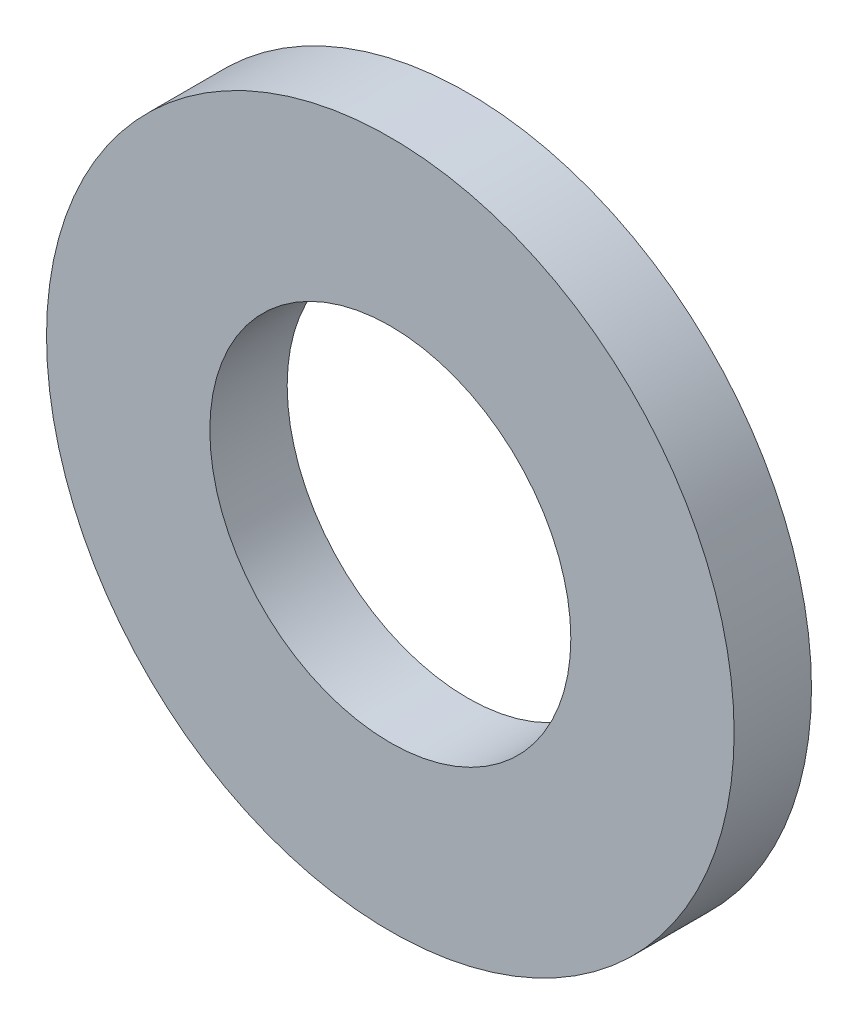
ISO-10303-21;
HEADER;
FILE_DESCRIPTION(('STEP AP214'),'2;1');
FILE_NAME('part.step','',(''),(''),'','','');
FILE_SCHEMA(('AUTOMOTIVE_DESIGN { 1 0 10303 214 1 1 1 1 }'));
ENDSEC;
DATA;
#1=APPLICATION_CONTEXT('core data for automotive mechanical design processes');
#2=APPLICATION_PROTOCOL_DEFINITION('international standard','automotive_design',2000,#1);
#3=PRODUCT_CONTEXT('',#1,'mechanical');
#4=PRODUCT('Part','Part','',(#3));
#5=PRODUCT_RELATED_PRODUCT_CATEGORY('part','',(#4));
#6=PRODUCT_DEFINITION_FORMATION('','',#4);
#7=PRODUCT_DEFINITION_CONTEXT('part definition',#1,'design');
#8=PRODUCT_DEFINITION('design','',#6,#7);
#9=PRODUCT_DEFINITION_SHAPE('','',#8);
#10=(LENGTH_UNIT() NAMED_UNIT(*) SI_UNIT(.MILLI.,.METRE.));
#11=(NAMED_UNIT(*) PLANE_ANGLE_UNIT() SI_UNIT($,.RADIAN.));
#12=(NAMED_UNIT(*) SI_UNIT($,.STERADIAN.) SOLID_ANGLE_UNIT());
#13=UNCERTAINTY_MEASURE_WITH_UNIT(LENGTH_MEASURE(1.E-05),#10,'distance_accuracy_value','');
#14=(GEOMETRIC_REPRESENTATION_CONTEXT(3) GLOBAL_UNCERTAINTY_ASSIGNED_CONTEXT((#13)) GLOBAL_UNIT_ASSIGNED_CONTEXT((#10,
#11,#12)) REPRESENTATION_CONTEXT('',''));
#15=CARTESIAN_POINT('',(0.,0.,0.));
#16=DIRECTION('',(0.,0.,1.));
#17=DIRECTION('',(1.,0.,0.));
#18=AXIS2_PLACEMENT_3D('',#15,#16,#17);
#19=CARTESIAN_POINT('',(0.,0.,0.));
#20=DIRECTION('',(0.,0.,1.));
#21=DIRECTION('',(1.,0.,0.));
#22=AXIS2_PLACEMENT_3D('',#19,#20,#21);
#23=PLANE('',#22);
#24=CARTESIAN_POINT('',(0.,0.,0.));
#25=DIRECTION('',(0.,0.,-1.));
#26=DIRECTION('',(-1.,0.,0.));
#27=AXIS2_PLACEMENT_3D('',#24,#25,#26);
#28=CIRCLE('',#27,4.19999999999999);
#29=CARTESIAN_POINT('',(-4.19999999999999,0.,0.));
#30=VERTEX_POINT('',#29);
#31=EDGE_CURVE('E26',#30,#30,#28,.F.);
#32=ORIENTED_EDGE('',*,*,#31,.T.);
#33=EDGE_LOOP('',(#32));
#34=FACE_BOUND('',#33,.T.);
#35=CARTESIAN_POINT('',(0.,0.,0.));
#36=DIRECTION('',(0.,0.,-1.));
#37=DIRECTION('',(-1.,0.,0.));
#38=AXIS2_PLACEMENT_3D('',#35,#36,#37);
#39=CIRCLE('',#38,8.);
#40=CARTESIAN_POINT('',(-8.,0.,0.));
#41=VERTEX_POINT('',#40);
#42=EDGE_CURVE('E17',#41,#41,#39,.F.);
#43=ORIENTED_EDGE('',*,*,#42,.F.);
#44=EDGE_LOOP('',(#43));
#45=FACE_BOUND('',#44,.T.);
#46=ADVANCED_FACE('F14',(#34,#45),#23,.F.);
#47=CARTESIAN_POINT('',(0.,0.,1.8));
#48=DIRECTION('',(0.,0.,-1.));
#49=DIRECTION('',(-1.,0.,0.));
#50=AXIS2_PLACEMENT_3D('',#47,#48,#49);
#51=CYLINDRICAL_SURFACE('',#50,8.);
#52=ORIENTED_EDGE('',*,*,#42,.T.);
#53=EDGE_LOOP('',(#52));
#54=FACE_BOUND('',#53,.T.);
#55=CARTESIAN_POINT('',(0.,0.,1.8));
#56=DIRECTION('',(0.,0.,-1.));
#57=DIRECTION('',(-1.,0.,0.));
#58=AXIS2_PLACEMENT_3D('',#55,#56,#57);
#59=CIRCLE('',#58,8.);
#60=CARTESIAN_POINT('',(-8.,0.,1.8));
#61=VERTEX_POINT('',#60);
#62=EDGE_CURVE('E21',#61,#61,#59,.F.);
#63=ORIENTED_EDGE('',*,*,#62,.F.);
#64=EDGE_LOOP('',(#63));
#65=FACE_BOUND('',#64,.T.);
#66=ADVANCED_FACE('F34',(#54,#65),#51,.T.);
#67=CARTESIAN_POINT('',(0.,0.,1.8));
#68=DIRECTION('',(0.,0.,-1.));
#69=DIRECTION('',(-1.,0.,0.));
#70=AXIS2_PLACEMENT_3D('',#67,#68,#69);
#71=CYLINDRICAL_SURFACE('',#70,4.19999999999999);
#72=ORIENTED_EDGE('',*,*,#31,.F.);
#73=EDGE_LOOP('',(#72));
#74=FACE_BOUND('',#73,.T.);
#75=CARTESIAN_POINT('',(0.,0.,1.8));
#76=DIRECTION('',(0.,0.,-1.));
#77=DIRECTION('',(-1.,0.,0.));
#78=AXIS2_PLACEMENT_3D('',#75,#76,#77);
#79=CIRCLE('',#78,4.19999999999999);
#80=CARTESIAN_POINT('',(-4.19999999999999,0.,1.8));
#81=VERTEX_POINT('',#80);
#82=EDGE_CURVE('E10',#81,#81,#79,.T.);
#83=ORIENTED_EDGE('',*,*,#82,.F.);
#84=EDGE_LOOP('',(#83));
#85=FACE_BOUND('',#84,.T.);
#86=ADVANCED_FACE('F42',(#74,#85),#71,.F.);
#87=CARTESIAN_POINT('',(0.,0.,1.8));
#88=DIRECTION('',(0.,0.,1.));
#89=DIRECTION('',(1.,0.,0.));
#90=AXIS2_PLACEMENT_3D('',#87,#88,#89);
#91=PLANE('',#90);
#92=ORIENTED_EDGE('',*,*,#82,.T.);
#93=EDGE_LOOP('',(#92));
#94=FACE_BOUND('',#93,.T.);
#95=ORIENTED_EDGE('',*,*,#62,.T.);
#96=EDGE_LOOP('',(#95));
#97=FACE_BOUND('',#96,.T.);
#98=ADVANCED_FACE('F43',(#94,#97),#91,.T.);
#99=CLOSED_SHELL('',(#46,#66,#86,#98));
#100=MANIFOLD_SOLID_BREP('B1',#99);
#101=ADVANCED_BREP_SHAPE_REPRESENTATION('',(#18,#100),#14);
#102=SHAPE_DEFINITION_REPRESENTATION(#9,#101);
ENDSEC;
END-ISO-10303-21;
